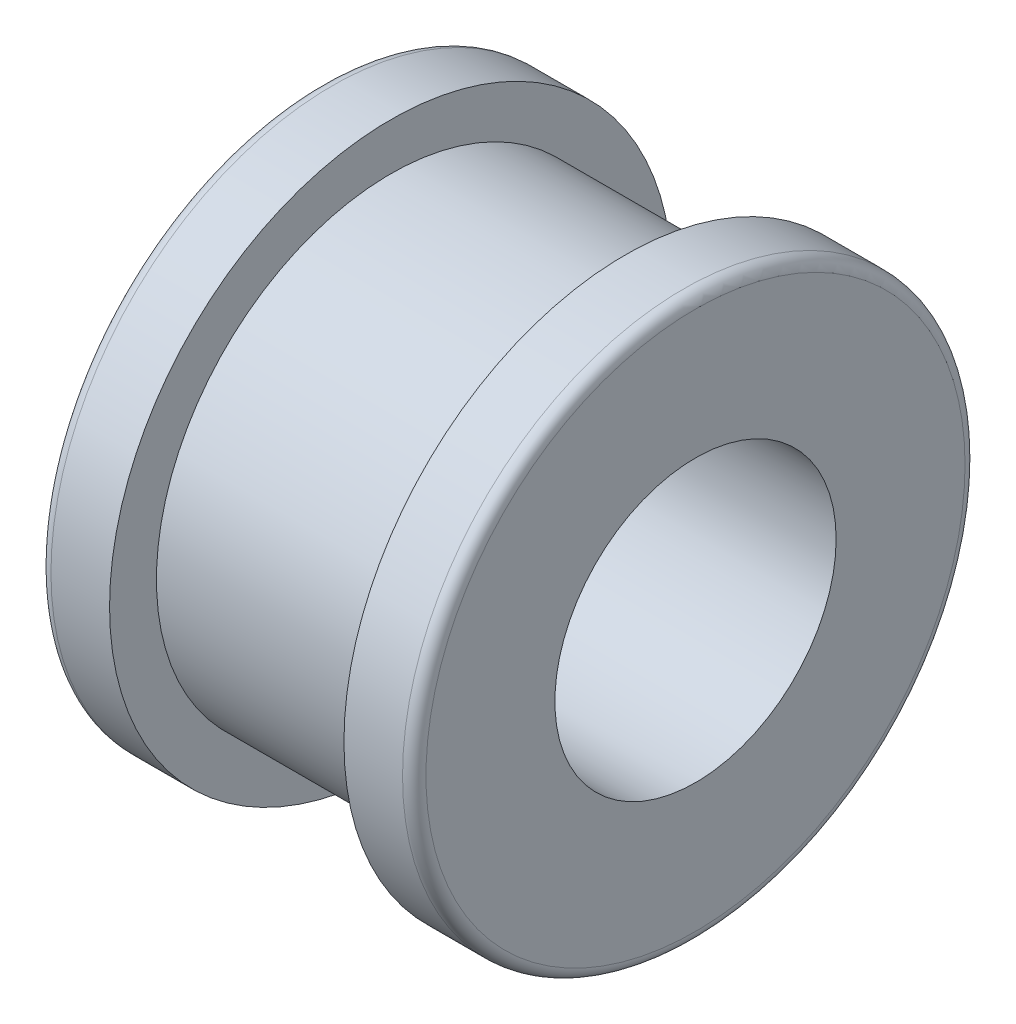
ISO-10303-21;
HEADER;
FILE_DESCRIPTION(('STEP AP214'),'2;1');
FILE_NAME('part.step','',(''),(''),'','','');
FILE_SCHEMA(('AUTOMOTIVE_DESIGN { 1 0 10303 214 1 1 1 1 }'));
ENDSEC;
DATA;
#1=APPLICATION_CONTEXT('core data for automotive mechanical design processes');
#2=APPLICATION_PROTOCOL_DEFINITION('international standard','automotive_design',2000,#1);
#3=PRODUCT_CONTEXT('',#1,'mechanical');
#4=PRODUCT('Part','Part','',(#3));
#5=PRODUCT_RELATED_PRODUCT_CATEGORY('part','',(#4));
#6=PRODUCT_DEFINITION_FORMATION('','',#4);
#7=PRODUCT_DEFINITION_CONTEXT('part definition',#1,'design');
#8=PRODUCT_DEFINITION('design','',#6,#7);
#9=PRODUCT_DEFINITION_SHAPE('','',#8);
#10=(LENGTH_UNIT() NAMED_UNIT(*) SI_UNIT(.MILLI.,.METRE.));
#11=(NAMED_UNIT(*) PLANE_ANGLE_UNIT() SI_UNIT($,.RADIAN.));
#12=(NAMED_UNIT(*) SI_UNIT($,.STERADIAN.) SOLID_ANGLE_UNIT());
#13=UNCERTAINTY_MEASURE_WITH_UNIT(LENGTH_MEASURE(1.E-05),#10,'distance_accuracy_value','');
#14=(GEOMETRIC_REPRESENTATION_CONTEXT(3) GLOBAL_UNCERTAINTY_ASSIGNED_CONTEXT((#13)) GLOBAL_UNIT_ASSIGNED_CONTEXT((#10,
#11,#12)) REPRESENTATION_CONTEXT('',''));
#15=CARTESIAN_POINT('',(0.,0.,0.));
#16=DIRECTION('',(0.,0.,1.));
#17=DIRECTION('',(1.,0.,0.));
#18=AXIS2_PLACEMENT_3D('',#15,#16,#17);
#19=CARTESIAN_POINT('',(8.,0.,0.));
#20=DIRECTION('',(-1.,0.,0.));
#21=DIRECTION('',(0.,0.,1.));
#22=AXIS2_PLACEMENT_3D('',#19,#20,#21);
#23=CYLINDRICAL_SURFACE('',#22,12.);
#24=CARTESIAN_POINT('',(-7.5,0.,0.));
#25=DIRECTION('',(1.,0.,0.));
#26=DIRECTION('',(0.,0.,-1.));
#27=AXIS2_PLACEMENT_3D('',#24,#25,#26);
#28=CIRCLE('',#27,12.);
#29=CARTESIAN_POINT('',(-7.5,0.,-12.));
#30=VERTEX_POINT('',#29);
#31=EDGE_CURVE('E54',#30,#30,#28,.T.);
#32=ORIENTED_EDGE('',*,*,#31,.T.);
#33=EDGE_LOOP('',(#32));
#34=FACE_BOUND('',#33,.T.);
#35=CARTESIAN_POINT('',(-5.,0.,0.));
#36=DIRECTION('',(1.,0.,0.));
#37=DIRECTION('',(0.,0.,-1.));
#38=AXIS2_PLACEMENT_3D('',#35,#36,#37);
#39=CIRCLE('',#38,12.);
#40=CARTESIAN_POINT('',(-5.,0.,-12.));
#41=VERTEX_POINT('',#40);
#42=EDGE_CURVE('E69',#41,#41,#39,.T.);
#43=ORIENTED_EDGE('',*,*,#42,.F.);
#44=EDGE_LOOP('',(#43));
#45=FACE_BOUND('',#44,.T.);
#46=ADVANCED_FACE('F40',(#34,#45),#23,.T.);
#47=CARTESIAN_POINT('',(-8.,0.,0.));
#48=DIRECTION('',(1.,0.,0.));
#49=DIRECTION('',(0.,0.,-1.));
#50=AXIS2_PLACEMENT_3D('',#47,#48,#49);
#51=PLANE('',#50);
#52=CARTESIAN_POINT('',(-8.,0.,0.));
#53=DIRECTION('',(1.,0.,0.));
#54=DIRECTION('',(0.,0.,-1.));
#55=AXIS2_PLACEMENT_3D('',#52,#53,#54);
#56=CIRCLE('',#55,11.5);
#57=CARTESIAN_POINT('',(-8.,0.,-11.5));
#58=VERTEX_POINT('',#57);
#59=EDGE_CURVE('E10',#58,#58,#56,.F.);
#60=ORIENTED_EDGE('',*,*,#59,.T.);
#61=EDGE_LOOP('',(#60));
#62=FACE_BOUND('',#61,.T.);
#63=CARTESIAN_POINT('',(-8.,0.,0.));
#64=DIRECTION('',(1.,0.,0.));
#65=DIRECTION('',(0.,0.,-1.));
#66=AXIS2_PLACEMENT_3D('',#63,#64,#65);
#67=CIRCLE('',#66,6.);
#68=CARTESIAN_POINT('',(-8.,0.,-6.));
#69=VERTEX_POINT('',#68);
#70=EDGE_CURVE('E82',#69,#69,#67,.T.);
#71=ORIENTED_EDGE('',*,*,#70,.T.);
#72=EDGE_LOOP('',(#71));
#73=FACE_BOUND('',#72,.T.);
#74=ADVANCED_FACE('F125',(#62,#73),#51,.F.);
#75=CARTESIAN_POINT('',(-5.,0.,0.));
#76=DIRECTION('',(1.,0.,0.));
#77=DIRECTION('',(0.,0.,-1.));
#78=AXIS2_PLACEMENT_3D('',#75,#76,#77);
#79=PLANE('',#78);
#80=CARTESIAN_POINT('',(-5.,0.,0.));
#81=DIRECTION('',(1.,0.,0.));
#82=DIRECTION('',(0.,0.,-1.));
#83=AXIS2_PLACEMENT_3D('',#80,#81,#82);
#84=CIRCLE('',#83,10.);
#85=CARTESIAN_POINT('',(-5.,0.,-10.));
#86=VERTEX_POINT('',#85);
#87=EDGE_CURVE('E74',#86,#86,#84,.T.);
#88=ORIENTED_EDGE('',*,*,#87,.F.);
#89=EDGE_LOOP('',(#88));
#90=FACE_BOUND('',#89,.T.);
#91=ORIENTED_EDGE('',*,*,#42,.T.);
#92=EDGE_LOOP('',(#91));
#93=FACE_BOUND('',#92,.T.);
#94=ADVANCED_FACE('F130',(#90,#93),#79,.T.);
#95=CARTESIAN_POINT('',(5.,0.,0.));
#96=DIRECTION('',(1.,0.,0.));
#97=DIRECTION('',(0.,0.,-1.));
#98=AXIS2_PLACEMENT_3D('',#95,#96,#97);
#99=PLANE('',#98);
#100=CARTESIAN_POINT('',(5.,0.,0.));
#101=DIRECTION('',(1.,0.,0.));
#102=DIRECTION('',(0.,0.,-1.));
#103=AXIS2_PLACEMENT_3D('',#100,#101,#102);
#104=CIRCLE('',#103,10.);
#105=CARTESIAN_POINT('',(5.,0.,-10.));
#106=VERTEX_POINT('',#105);
#107=EDGE_CURVE('E78',#106,#106,#104,.T.);
#108=ORIENTED_EDGE('',*,*,#107,.T.);
#109=EDGE_LOOP('',(#108));
#110=FACE_BOUND('',#109,.T.);
#111=CARTESIAN_POINT('',(5.,0.,0.));
#112=DIRECTION('',(1.,0.,0.));
#113=DIRECTION('',(0.,0.,-1.));
#114=AXIS2_PLACEMENT_3D('',#111,#112,#113);
#115=CIRCLE('',#114,12.);
#116=CARTESIAN_POINT('',(5.,0.,-12.));
#117=VERTEX_POINT('',#116);
#118=EDGE_CURVE('E70',#117,#117,#115,.T.);
#119=ORIENTED_EDGE('',*,*,#118,.F.);
#120=EDGE_LOOP('',(#119));
#121=FACE_BOUND('',#120,.T.);
#122=ADVANCED_FACE('F137',(#110,#121),#99,.F.);
#123=CARTESIAN_POINT('',(-5.,0.,0.));
#124=DIRECTION('',(1.,0.,0.));
#125=DIRECTION('',(0.,0.,-1.));
#126=AXIS2_PLACEMENT_3D('',#123,#124,#125);
#127=CYLINDRICAL_SURFACE('',#126,10.);
#128=CARTESIAN_POINT('',(1.,-10.,0.));
#129=CARTESIAN_POINT('',(0.99999757409962,-9.99999935520769,0.0560203537915572));
#130=CARTESIAN_POINT('',(0.995276731103556,-9.99952425596206,0.112077745167773));
#131=CARTESIAN_POINT('',(0.976515629709573,-9.99767467594738,0.222638398496837));
#132=CARTESIAN_POINT('',(0.962465103975411,-9.99629920434026,0.277139879168828));
#133=CARTESIAN_POINT('',(0.925457759402168,-9.9928041456307,0.382971675453414));
#134=CARTESIAN_POINT('',(0.902506319481526,-9.99068500800708,0.434303884614909));
#135=CARTESIAN_POINT('',(0.848359092068356,-9.98593957394306,0.532376160960406));
#136=CARTESIAN_POINT('',(0.817164943999862,-9.98331337838132,0.579117138779076));
#137=CARTESIAN_POINT('',(0.747297302337726,-9.97783744341324,0.666859550674082));
#138=CARTESIAN_POINT('',(0.708600200597966,-9.97498701573866,0.707842144834892));
#139=CARTESIAN_POINT('',(0.62487546573697,-9.96938956906263,0.782742521430984));
#140=CARTESIAN_POINT('',(0.579847539957613,-9.96664255484917,0.816659977082653));
#141=CARTESIAN_POINT('',(0.484621468316379,-9.96155591552784,0.876533970443617));
#142=CARTESIAN_POINT('',(0.434412555905142,-9.95921716710905,0.902473465454879));
#143=CARTESIAN_POINT('',(0.330324414095021,-9.95522037546525,0.94554638474276));
#144=CARTESIAN_POINT('',(0.27644527541605,-9.95356231542222,0.962680026591291));
#145=CARTESIAN_POINT('',(0.166738199133991,-9.95112084072978,0.987599041601893));
#146=CARTESIAN_POINT('',(0.110917423147792,-9.95033450398097,0.995415653003795));
#147=CARTESIAN_POINT('',(-0.00124886339578044,-9.94971643060526,1.00157528513536));
#148=CARTESIAN_POINT('',(-0.0575943601220591,-9.94988466888746,0.999918554870802));
#149=CARTESIAN_POINT('',(-0.168995309693318,-9.95115406898935,0.987204280252678));
#150=CARTESIAN_POINT('',(-0.224054699328694,-9.95225184590651,0.976180844124552));
#151=CARTESIAN_POINT('',(-0.331537963201094,-9.95525134287419,0.945099144150586));
#152=CARTESIAN_POINT('',(-0.383961801825031,-9.95715307378492,0.925040758255746));
#153=CARTESIAN_POINT('',(-0.484793587298889,-9.9615500945207,0.876420893881507));
#154=CARTESIAN_POINT('',(-0.533194189489316,-9.96404643908158,0.84784428271998));
#155=CARTESIAN_POINT('',(-0.624525214911882,-9.96935051732879,0.783010027353227));
#156=CARTESIAN_POINT('',(-0.667455477981763,-9.97215826012785,0.746752158336505));
#157=CARTESIAN_POINT('',(-0.746825393989027,-9.9777838531299,0.667394112412069));
#158=CARTESIAN_POINT('',(-0.783235601880805,-9.98060169332997,0.624264478851363));
#159=CARTESIAN_POINT('',(-0.848303632910388,-9.98591829078518,0.532489481737112));
#160=CARTESIAN_POINT('',(-0.876961447356476,-9.98841704768256,0.483844111999601));
#161=CARTESIAN_POINT('',(-0.925710020310253,-9.99281475667096,0.382398105692365));
#162=CARTESIAN_POINT('',(-0.945799284818062,-9.9947136041477,0.329596746389903));
#163=CARTESIAN_POINT('',(-0.976818916711752,-9.99769647441409,0.221347217329932));
#164=CARTESIAN_POINT('',(-0.987749557990623,-9.99878052157063,0.1658991267766));
#165=CARTESIAN_POINT('',(-1.00010430773477,-10.0000085166831,0.0541850990919041));
#166=CARTESIAN_POINT('',(-1.0015690482525,-10.0001564826774,-0.00207630210549165));
#167=CARTESIAN_POINT('',(-0.995057136951236,-9.99950641756797,-0.114043793315699));
#168=CARTESIAN_POINT('',(-0.98708061268472,-9.99870839924468,-0.16974989082047));
#169=CARTESIAN_POINT('',(-0.961946304578424,-9.99625861539194,-0.278908206834674));
#170=CARTESIAN_POINT('',(-0.944807545521989,-9.99460861918039,-0.332364848972019));
#171=CARTESIAN_POINT('',(-0.901854825962729,-9.99063998860609,-0.435644321383781));
#172=CARTESIAN_POINT('',(-0.876040670960603,-9.98832133925254,-0.485467070157117));
#173=CARTESIAN_POINT('',(-0.816369161336087,-9.98326475330422,-0.580248180172142));
#174=CARTESIAN_POINT('',(-0.782485111074183,-9.98052543603441,-0.625189659748917));
#175=CARTESIAN_POINT('',(-0.707673932259073,-9.9749393286952,-0.708761623311878));
#176=CARTESIAN_POINT('',(-0.666746626929683,-9.97209253592971,-0.747391948849177));
#177=CARTESIAN_POINT('',(-0.578833425340999,-9.96660024140755,-0.817386109887145));
#178=CARTESIAN_POINT('',(-0.531826243457378,-9.96395550138975,-0.848723278679543));
#179=CARTESIAN_POINT('',(-0.433192639853315,-9.9591783246089,-0.903058258743828));
#180=CARTESIAN_POINT('',(-0.381566281311604,-9.95704588084038,-0.926056184053882));
#181=CARTESIAN_POINT('',(-0.275251260534206,-9.9535394763405,-0.963015208684475));
#182=CARTESIAN_POINT('',(-0.220568159908879,-9.95216418449789,-0.976992174811861));
#183=CARTESIAN_POINT('',(-0.109616802039228,-9.95032365282877,-0.995564007129462));
#184=CARTESIAN_POINT('',(-0.0533485903043259,-9.94985838690186,-1.00015914239952));
#185=CARTESIAN_POINT('',(0.0589106883567047,-9.94989113107562,-0.999833138471256));
#186=CARTESIAN_POINT('',(0.114901882882815,-9.95038490087009,-0.994953889593112));
#187=CARTESIAN_POINT('',(0.225264917168288,-9.95227103889546,-0.975905452963653));
#188=CARTESIAN_POINT('',(0.27963675510598,-9.95366340813719,-0.96173625476216));
#189=CARTESIAN_POINT('',(0.385217349047857,-9.95718868263187,-0.924521686297503));
#190=CARTESIAN_POINT('',(0.436426541629725,-9.95932148540361,-0.901477544340916));
#191=CARTESIAN_POINT('',(0.534256891671035,-9.96408751839359,-0.847171554911043));
#192=CARTESIAN_POINT('',(0.58087807482063,-9.96672074580951,-0.815909753455415));
#193=CARTESIAN_POINT('',(0.668423674471935,-9.97220487209698,-0.745898556285331));
#194=CARTESIAN_POINT('',(0.709323076367086,-9.97505664726751,-0.707117948890268));
#195=CARTESIAN_POINT('',(0.784052232699658,-9.98064854728783,-0.623231699225109));
#196=CARTESIAN_POINT('',(0.81788029135717,-9.98338864522976,-0.578124544108257));
#197=CARTESIAN_POINT('',(0.877573453854621,-9.98845562069162,-0.482741434161289));
#198=CARTESIAN_POINT('',(0.903418290945183,-9.99078144026812,-0.432452749346764));
#199=CARTESIAN_POINT('',(0.946262422823868,-9.99474629249896,-0.328258279100551));
#200=CARTESIAN_POINT('',(0.963271690953547,-9.99638609909654,-0.274356649825609));
#201=CARTESIAN_POINT('',(0.983720617084802,-9.99838213773734,-0.183458261405704));
#202=CARTESIAN_POINT('',(0.989817044299357,-9.99898600691833,-0.147042552844509));
#203=CARTESIAN_POINT('',(0.997957526061762,-9.99979514950786,-0.073756580817313));
#204=CARTESIAN_POINT('',(1.00000159732186,-10.0000004245602,-0.0368863192265578));
#205=CARTESIAN_POINT('',(1.,-10.,0.));
#206=B_SPLINE_CURVE_WITH_KNOTS('',3,(#128,#129,#130,#131,#132,#133,#134,#135,#136,#137,#138,
#139,#140,#141,#142,#143,#144,#145,#146,#147,#148,#149,#150,#151,#152,#153,#154,#155,#156,#157,
#158,#159,#160,#161,#162,#163,#164,#165,#166,#167,#168,#169,#170,#171,#172,#173,#174,#175,#176,
#177,#178,#179,#180,#181,#182,#183,#184,#185,#186,#187,#188,#189,#190,#191,#192,#193,#194,#195,
#196,#197,#198,#199,#200,#201,#202,#203,#204,#205),.UNSPECIFIED.,.T.,.F.,(4,2,2,2,2,2,2,2,2,2,2,
2,2,2,2,2,2,2,2,2,2,2,2,2,2,2,2,2,2,2,2,2,2,2,2,2,2,2,4),(0.,0.167926366268474,
0.336037842835486,0.504047885732202,0.672024537582782,0.840538568622945,1.00906039220706,
1.17793975472222,1.34681494442504,1.51512232045197,1.68342527255776,1.8511179744111,
2.01881294161634,2.18680761372895,2.35480720331125,2.52354734196207,2.69228766979772,
2.86105740693581,3.02982209675439,3.19786188607758,3.36589940519143,3.53358935294305,
3.70128306049467,3.86953940748698,4.0377999781023,4.20666643608598,4.37553058475374,
4.54409690593003,4.71265839239585,4.88047629293956,5.04829438226039,5.216089253628,
5.3838831853896,5.55238917427653,5.72093552636958,5.88990631026242,6.05868594795295,
6.16925667232348,6.27982694069027),.UNSPECIFIED.);
#207=CARTESIAN_POINT('',(1.,-10.,0.));
#208=VERTEX_POINT('',#207);
#209=EDGE_CURVE('E93',#208,#208,#206,.T.);
#210=ORIENTED_EDGE('',*,*,#209,.F.);
#211=EDGE_LOOP('',(#210));
#212=FACE_BOUND('',#211,.T.);
#213=ORIENTED_EDGE('',*,*,#87,.T.);
#214=EDGE_LOOP('',(#213));
#215=FACE_BOUND('',#214,.T.);
#216=ORIENTED_EDGE('',*,*,#107,.F.);
#217=EDGE_LOOP('',(#216));
#218=FACE_BOUND('',#217,.T.);
#219=ADVANCED_FACE('F100',(#212,#215,#218),#127,.T.);
#220=CARTESIAN_POINT('',(8.,0.,0.));
#221=DIRECTION('',(1.,0.,0.));
#222=DIRECTION('',(0.,0.,-1.));
#223=AXIS2_PLACEMENT_3D('',#220,#221,#222);
#224=PLANE('',#223);
#225=CARTESIAN_POINT('',(8.,0.,0.));
#226=DIRECTION('',(1.,0.,0.));
#227=DIRECTION('',(0.,0.,-1.));
#228=AXIS2_PLACEMENT_3D('',#225,#226,#227);
#229=CIRCLE('',#228,11.5);
#230=CARTESIAN_POINT('',(8.,0.,-11.5));
#231=VERTEX_POINT('',#230);
#232=EDGE_CURVE('E65',#231,#231,#229,.T.);
#233=ORIENTED_EDGE('',*,*,#232,.T.);
#234=EDGE_LOOP('',(#233));
#235=FACE_BOUND('',#234,.T.);
#236=CARTESIAN_POINT('',(8.,0.,0.));
#237=DIRECTION('',(1.,0.,0.));
#238=DIRECTION('',(0.,0.,-1.));
#239=AXIS2_PLACEMENT_3D('',#236,#237,#238);
#240=CIRCLE('',#239,6.);
#241=CARTESIAN_POINT('',(8.,0.,-6.));
#242=VERTEX_POINT('',#241);
#243=EDGE_CURVE('E89',#242,#242,#240,.T.);
#244=ORIENTED_EDGE('',*,*,#243,.F.);
#245=EDGE_LOOP('',(#244));
#246=FACE_BOUND('',#245,.T.);
#247=ADVANCED_FACE('F119',(#235,#246),#224,.T.);
#248=CARTESIAN_POINT('',(7.5,0.,0.));
#249=DIRECTION('',(1.,0.,0.));
#250=DIRECTION('',(0.,0.,-1.));
#251=AXIS2_PLACEMENT_3D('',#248,#249,#250);
#252=CIRCLE('',#251,12.);
#253=CARTESIAN_POINT('',(7.5,0.,-12.));
#254=VERTEX_POINT('',#253);
#255=EDGE_CURVE('E59',#254,#254,#252,.F.);
#256=ORIENTED_EDGE('',*,*,#255,.T.);
#257=EDGE_LOOP('',(#256));
#258=FACE_BOUND('',#257,.T.);
#259=ORIENTED_EDGE('',*,*,#118,.T.);
#260=EDGE_LOOP('',(#259));
#261=FACE_BOUND('',#260,.T.);
#262=ADVANCED_FACE('F112',(#258,#261),#23,.T.);
#263=CARTESIAN_POINT('',(-8.,0.,0.));
#264=DIRECTION('',(1.,0.,0.));
#265=DIRECTION('',(0.,0.,-1.));
#266=AXIS2_PLACEMENT_3D('',#263,#264,#265);
#267=CYLINDRICAL_SURFACE('',#266,6.);
#268=CARTESIAN_POINT('',(0.,-5.91607978309962,1.));
#269=CARTESIAN_POINT('',(-0.0557502992584118,-5.91608078960511,0.999997759368402));
#270=CARTESIAN_POINT('',(-0.111531042409948,-5.91687637019227,0.995322067614928));
#271=CARTESIAN_POINT('',(-0.221527417288066,-5.91996982947271,0.976750971230157));
#272=CARTESIAN_POINT('',(-0.27574155749981,-5.92226909356571,0.962847064123861));
#273=CARTESIAN_POINT('',(-0.380996913342711,-5.9281024372893,0.926251817466857));
#274=CARTESIAN_POINT('',(-0.432040739466525,-5.9316354846878,0.903567821972435));
#275=CARTESIAN_POINT('',(-0.529592381885484,-5.93953708845736,0.850074598756146));
#276=CARTESIAN_POINT('',(-0.576100707830495,-5.94390555078989,0.819266285400627));
#277=CARTESIAN_POINT('',(-0.663725139898267,-5.95303388461044,0.75007501078652));
#278=CARTESIAN_POINT('',(-0.704790052554605,-5.95779686930827,0.711627619572909));
#279=CARTESIAN_POINT('',(-0.779917322744606,-5.96714992267783,0.628388801878136));
#280=CARTESIAN_POINT('',(-0.813979265246135,-5.97173998108788,0.583596999659995));
#281=CARTESIAN_POINT('',(-0.874325826887742,-5.98026294792988,0.488609147979335));
#282=CARTESIAN_POINT('',(-0.90056280309273,-5.98419176972911,0.438382432582681));
#283=CARTESIAN_POINT('',(-0.944208428212213,-5.99091494782862,0.334158248689549));
#284=CARTESIAN_POINT('',(-0.961617651153948,-5.9937093778907,0.280161025631276));
#285=CARTESIAN_POINT('',(-0.986957013993562,-5.99782693889752,0.170457490537697));
#286=CARTESIAN_POINT('',(-0.994973166401878,-5.99916341244362,0.114771554671708));
#287=CARTESIAN_POINT('',(-1.00156630166104,-6.00026031737113,0.00283011421031905));
#288=CARTESIAN_POINT('',(-1.00014392609889,-6.00002085587723,-0.0534253514115594));
#289=CARTESIAN_POINT('',(-0.987967459388716,-5.99800343372556,-0.16432087403155));
#290=CARTESIAN_POINT('',(-0.977305934636339,-5.99624073476959,-0.218971412280056));
#291=CARTESIAN_POINT('',(-0.947099570301403,-5.99139191508655,-0.325696791844717));
#292=CARTESIAN_POINT('',(-0.9275544601642,-5.98830575405284,-0.377771554660602));
#293=CARTESIAN_POINT('',(-0.880043743873873,-5.98113079404783,-0.478142459113059));
#294=CARTESIAN_POINT('',(-0.852039995167024,-5.97703746930752,-0.526420209207618));
#295=CARTESIAN_POINT('',(-0.78843487094598,-5.96830295228599,-0.617626211938657));
#296=CARTESIAN_POINT('',(-0.752832880515673,-5.96366171567654,-0.66055403116635));
#297=CARTESIAN_POINT('',(-0.674528477352277,-5.95428107293039,-0.740388509378666));
#298=CARTESIAN_POINT('',(-0.631745162039607,-5.94954115892417,-0.777215800901283));
#299=CARTESIAN_POINT('',(-0.540565163913672,-5.94055183913922,-0.843181835379226));
#300=CARTESIAN_POINT('',(-0.492168429326872,-5.9363024378853,-0.872320507412967));
#301=CARTESIAN_POINT('',(-0.391043343249008,-5.92877501824727,-0.922097773795314));
#302=CARTESIAN_POINT('',(-0.338310200763164,-5.92549809321041,-0.942726810911697));
#303=CARTESIAN_POINT('',(-0.230060371076983,-5.92030475475952,-0.974811948326247));
#304=CARTESIAN_POINT('',(-0.174543929427031,-5.91838822155329,-0.986268856307182));
#305=CARTESIAN_POINT('',(-0.0630135375351475,-5.91615583768847,-0.999572753951706));
#306=CARTESIAN_POINT('',(-0.00701344811915934,-5.91582114303468,-1.00153288316498));
#307=CARTESIAN_POINT('',(0.104514668676328,-5.91674013912945,-0.996089081072983));
#308=CARTESIAN_POINT('',(0.160042714205589,-5.91799376852741,-0.988685511449866));
#309=CARTESIAN_POINT('',(0.268691103676343,-5.92193074982007,-0.964820933971239));
#310=CARTESIAN_POINT('',(0.321824455951204,-5.92460500767339,-0.948417516258554));
#311=CARTESIAN_POINT('',(0.424588066511794,-5.93107429202201,-0.907079276076911));
#312=CARTESIAN_POINT('',(0.474218115020361,-5.93486938556232,-0.882143943240374));
#313=CARTESIAN_POINT('',(0.569069837762444,-5.94319651358957,-0.824182669291691));
#314=CARTESIAN_POINT('',(0.614246629102423,-5.94773502240139,-0.791084225663745));
#315=CARTESIAN_POINT('',(0.698445413078001,-5.95701866671947,-0.717835786283193));
#316=CARTESIAN_POINT('',(0.737466972443896,-5.96176381674133,-0.677685294553618));
#317=CARTESIAN_POINT('',(0.808660757091481,-5.97098568847306,-0.590971228131524));
#318=CARTESIAN_POINT('',(0.840757530513817,-5.97545910537869,-0.544345301354478));
#319=CARTESIAN_POINT('',(0.896662130801952,-5.98358044973177,-0.44629737917973));
#320=CARTESIAN_POINT('',(0.92047022578954,-5.9872284038799,-0.394875538988251));
#321=CARTESIAN_POINT('',(0.959004233581946,-5.99327343267833,-0.288919620600531));
#322=CARTESIAN_POINT('',(0.973769630293967,-5.99567593827049,-0.234400225041044));
#323=CARTESIAN_POINT('',(0.993926239585532,-5.99898233267713,-0.123612293949685));
#324=CARTESIAN_POINT('',(0.999318223492944,-5.99988634480071,-0.0673439027286497));
#325=CARTESIAN_POINT('',(1.00055275292488,-6.0000921515513,0.044616510309472));
#326=CARTESIAN_POINT('',(0.996510101576422,-5.99941320809696,0.100307264241071));
#327=CARTESIAN_POINT('',(0.97923843109224,-5.99656871354913,0.210204789725876));
#328=CARTESIAN_POINT('',(0.966009463396175,-5.99440317078001,0.26441156958697));
#329=CARTESIAN_POINT('',(0.930784733782497,-5.98882795531034,0.369758578367437));
#330=CARTESIAN_POINT('',(0.908798732715821,-5.98541966816622,0.420902148861609));
#331=CARTESIAN_POINT('',(0.856696825507926,-5.97773102750941,0.518792181192786));
#332=CARTESIAN_POINT('',(0.826580533975613,-5.97345063265953,0.565538434446986));
#333=CARTESIAN_POINT('',(0.758665963015201,-5.96443051847589,0.653885178210864));
#334=CARTESIAN_POINT('',(0.72078361809725,-5.95968609820294,0.695420572242245));
#335=CARTESIAN_POINT('',(0.638588676840723,-5.95030521321901,0.771585550379217));
#336=CARTESIAN_POINT('',(0.594274576443382,-5.94566877405441,0.806213514680476));
#337=CARTESIAN_POINT('',(0.500101870996945,-5.93699337428039,0.867805708367845));
#338=CARTESIAN_POINT('',(0.450206264064781,-5.93295887192494,0.894713995637815));
#339=CARTESIAN_POINT('',(0.346556305635426,-5.92599684088708,0.939725814576364));
#340=CARTESIAN_POINT('',(0.292805870921243,-5.92306820700509,0.95783814209264));
#341=CARTESIAN_POINT('',(0.199038492209334,-5.91929897935112,0.980810421248857));
#342=CARTESIAN_POINT('',(0.159589276816625,-5.91809849368407,0.987994967068111));
#343=CARTESIAN_POINT('',(0.0800986060635565,-5.91648854114608,0.997590518072968));
#344=CARTESIAN_POINT('',(0.0400571614679344,-5.91607905991511,1.00000160991677));
#345=CARTESIAN_POINT('',(0.,-5.91607978309962,1.));
#346=B_SPLINE_CURVE_WITH_KNOTS('',3,(#268,#269,#270,#271,#272,#273,#274,#275,#276,#277,#278,
#279,#280,#281,#282,#283,#284,#285,#286,#287,#288,#289,#290,#291,#292,#293,#294,#295,#296,#297,
#298,#299,#300,#301,#302,#303,#304,#305,#306,#307,#308,#309,#310,#311,#312,#313,#314,#315,#316,
#317,#318,#319,#320,#321,#322,#323,#324,#325,#326,#327,#328,#329,#330,#331,#332,#333,#334,#335,
#336,#337,#338,#339,#340,#341,#342,#343,#344,#345),.UNSPECIFIED.,.T.,.F.,(4,2,2,2,2,2,2,2,2,2,2,
2,2,2,2,2,2,2,2,2,2,2,2,2,2,2,2,2,2,2,2,2,2,2,2,2,2,2,4),(0.,0.167104415562128,
0.334363007967779,0.501481999132666,0.668582189603687,0.83715663660545,1.00574107132038,
1.17533192042833,1.34491174042704,1.51292626987285,1.68092937859336,1.84726848464127,
2.01361265698072,2.18071841654029,2.34783770488965,2.51698449383108,2.68613284296667,
2.85547064997701,3.0247935437349,3.19209416966423,3.3593883336385,3.52562425852456,
3.69187012915689,3.8596493710334,4.02744041770535,4.19697645212412,4.36650700188938,
4.53529193765317,4.70406298363199,4.87079110504626,5.03751829285788,5.20406015931242,
5.37060992155193,5.5390679898356,5.70756551550984,5.8772549104514,6.04677426695051,
6.16684268214775,6.28690891757997),.UNSPECIFIED.);
#347=CARTESIAN_POINT('',(0.,-5.91607978309962,1.));
#348=VERTEX_POINT('',#347);
#349=EDGE_CURVE('E44',#348,#348,#346,.T.);
#350=ORIENTED_EDGE('',*,*,#349,.T.);
#351=EDGE_LOOP('',(#350));
#352=FACE_BOUND('',#351,.T.);
#353=ORIENTED_EDGE('',*,*,#70,.F.);
#354=EDGE_LOOP('',(#353));
#355=FACE_BOUND('',#354,.T.);
#356=ORIENTED_EDGE('',*,*,#243,.T.);
#357=EDGE_LOOP('',(#356));
#358=FACE_BOUND('',#357,.T.);
#359=ADVANCED_FACE('F107',(#352,#355,#358),#267,.F.);
#360=CARTESIAN_POINT('',(7.5,0.,0.));
#361=DIRECTION('',(1.,0.,0.));
#362=DIRECTION('',(0.,0.,-1.));
#363=AXIS2_PLACEMENT_3D('',#360,#361,#362);
#364=TOROIDAL_SURFACE('',#363,11.5,0.5);
#365=ORIENTED_EDGE('',*,*,#255,.F.);
#366=EDGE_LOOP('',(#365));
#367=FACE_BOUND('',#366,.T.);
#368=ORIENTED_EDGE('',*,*,#232,.F.);
#369=EDGE_LOOP('',(#368));
#370=FACE_BOUND('',#369,.T.);
#371=ADVANCED_FACE('F111',(#367,#370),#364,.T.);
#372=CARTESIAN_POINT('',(-7.5,0.,0.));
#373=DIRECTION('',(1.,0.,0.));
#374=DIRECTION('',(0.,0.,-1.));
#375=AXIS2_PLACEMENT_3D('',#372,#373,#374);
#376=TOROIDAL_SURFACE('',#375,11.5,0.5);
#377=ORIENTED_EDGE('',*,*,#59,.F.);
#378=EDGE_LOOP('',(#377));
#379=FACE_BOUND('',#378,.T.);
#380=ORIENTED_EDGE('',*,*,#31,.F.);
#381=EDGE_LOOP('',(#380));
#382=FACE_BOUND('',#381,.T.);
#383=ADVANCED_FACE('F42',(#379,#382),#376,.T.);
#384=CARTESIAN_POINT('',(0.,-10.,0.));
#385=DIRECTION('',(0.,1.,0.));
#386=DIRECTION('',(0.,0.,1.));
#387=AXIS2_PLACEMENT_3D('',#384,#385,#386);
#388=CYLINDRICAL_SURFACE('',#387,1.);
#389=ORIENTED_EDGE('',*,*,#209,.T.);
#390=EDGE_LOOP('',(#389));
#391=FACE_BOUND('',#390,.T.);
#392=ORIENTED_EDGE('',*,*,#349,.F.);
#393=EDGE_LOOP('',(#392));
#394=FACE_BOUND('',#393,.T.);
#395=ADVANCED_FACE('F103',(#391,#394),#388,.F.);
#396=CLOSED_SHELL('',(#46,#74,#94,#122,#219,#247,#262,#359,#371,#383,#395));
#397=MANIFOLD_SOLID_BREP('B2',#396);
#398=ADVANCED_BREP_SHAPE_REPRESENTATION('',(#18,#397),#14);
#399=SHAPE_DEFINITION_REPRESENTATION(#9,#398);
ENDSEC;
END-ISO-10303-21;
